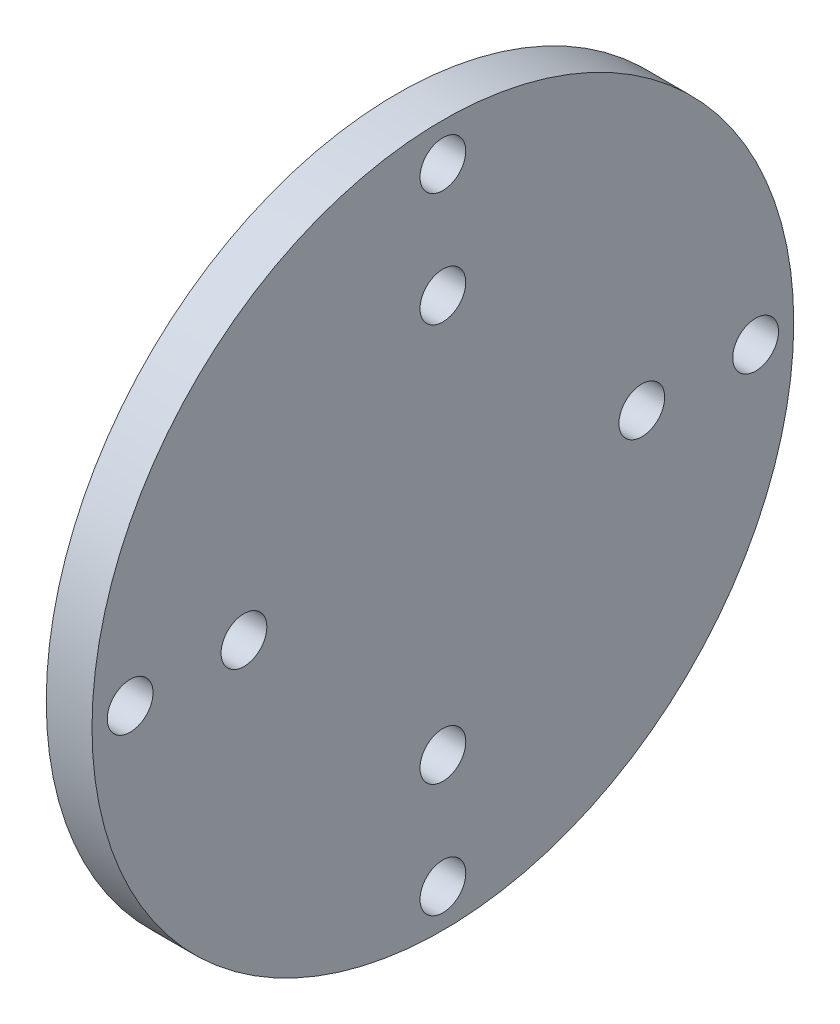
ISO-10303-21;
HEADER;
FILE_DESCRIPTION(('STEP AP214'),'2;1');
FILE_NAME('part.step','',(''),(''),'','','');
FILE_SCHEMA(('AUTOMOTIVE_DESIGN { 1 0 10303 214 1 1 1 1 }'));
ENDSEC;
DATA;
#1=APPLICATION_CONTEXT('core data for automotive mechanical design processes');
#2=APPLICATION_PROTOCOL_DEFINITION('international standard','automotive_design',2000,#1);
#3=PRODUCT_CONTEXT('',#1,'mechanical');
#4=PRODUCT('Part','Part','',(#3));
#5=PRODUCT_RELATED_PRODUCT_CATEGORY('part','',(#4));
#6=PRODUCT_DEFINITION_FORMATION('','',#4);
#7=PRODUCT_DEFINITION_CONTEXT('part definition',#1,'design');
#8=PRODUCT_DEFINITION('design','',#6,#7);
#9=PRODUCT_DEFINITION_SHAPE('','',#8);
#10=(LENGTH_UNIT() NAMED_UNIT(*) SI_UNIT(.MILLI.,.METRE.));
#11=(NAMED_UNIT(*) PLANE_ANGLE_UNIT() SI_UNIT($,.RADIAN.));
#12=(NAMED_UNIT(*) SI_UNIT($,.STERADIAN.) SOLID_ANGLE_UNIT());
#13=UNCERTAINTY_MEASURE_WITH_UNIT(LENGTH_MEASURE(1.E-05),#10,'distance_accuracy_value','');
#14=(GEOMETRIC_REPRESENTATION_CONTEXT(3) GLOBAL_UNCERTAINTY_ASSIGNED_CONTEXT((#13)) GLOBAL_UNIT_ASSIGNED_CONTEXT((#10,
#11,#12)) REPRESENTATION_CONTEXT('',''));
#15=CARTESIAN_POINT('',(0.,0.,0.));
#16=DIRECTION('',(0.,0.,1.));
#17=DIRECTION('',(1.,0.,0.));
#18=AXIS2_PLACEMENT_3D('',#15,#16,#17);
#19=CARTESIAN_POINT('',(3.,16.5,0.));
#20=DIRECTION('',(1.,0.,0.));
#21=DIRECTION('',(0.,0.,-1.));
#22=AXIS2_PLACEMENT_3D('',#19,#20,#21);
#23=PLANE('',#22);
#24=CARTESIAN_POINT('',(3.,16.4999999999998,-20.5));
#25=DIRECTION('',(1.,0.,0.));
#26=DIRECTION('',(0.,0.,-1.));
#27=AXIS2_PLACEMENT_3D('',#24,#25,#26);
#28=CIRCLE('',#27,1.5);
#29=CARTESIAN_POINT('',(3.,16.4999999999998,-22.));
#30=VERTEX_POINT('',#29);
#31=EDGE_CURVE('E96',#30,#30,#28,.T.);
#32=ORIENTED_EDGE('',*,*,#31,.F.);
#33=EDGE_LOOP('',(#32));
#34=FACE_BOUND('',#33,.T.);
#35=CARTESIAN_POINT('',(3.,37.,-1.41492685052928E-13));
#36=DIRECTION('',(1.,0.,0.));
#37=DIRECTION('',(0.,0.,-1.));
#38=AXIS2_PLACEMENT_3D('',#35,#36,#37);
#39=CIRCLE('',#38,1.5);
#40=CARTESIAN_POINT('',(3.,37.,-1.50000000000014));
#41=VERTEX_POINT('',#40);
#42=EDGE_CURVE('E80',#41,#41,#39,.T.);
#43=ORIENTED_EDGE('',*,*,#42,.F.);
#44=EDGE_LOOP('',(#43));
#45=FACE_BOUND('',#44,.T.);
#46=CARTESIAN_POINT('',(3.,16.5000000000001,20.5));
#47=DIRECTION('',(1.,0.,0.));
#48=DIRECTION('',(0.,0.,-1.));
#49=AXIS2_PLACEMENT_3D('',#46,#47,#48);
#50=CIRCLE('',#49,1.5);
#51=CARTESIAN_POINT('',(3.,16.5000000000001,19.));
#52=VERTEX_POINT('',#51);
#53=EDGE_CURVE('E64',#52,#52,#50,.T.);
#54=ORIENTED_EDGE('',*,*,#53,.F.);
#55=EDGE_LOOP('',(#54));
#56=FACE_BOUND('',#55,.T.);
#57=CARTESIAN_POINT('',(3.,-4.,0.));
#58=DIRECTION('',(1.,0.,0.));
#59=DIRECTION('',(0.,0.,-1.));
#60=AXIS2_PLACEMENT_3D('',#57,#58,#59);
#61=CIRCLE('',#60,1.5);
#62=CARTESIAN_POINT('',(3.,-4.,-1.5));
#63=VERTEX_POINT('',#62);
#64=EDGE_CURVE('E50',#63,#63,#61,.T.);
#65=ORIENTED_EDGE('',*,*,#64,.F.);
#66=EDGE_LOOP('',(#65));
#67=FACE_BOUND('',#66,.T.);
#68=CARTESIAN_POINT('',(3.,16.5,0.));
#69=DIRECTION('',(1.,0.,0.));
#70=DIRECTION('',(0.,0.,-1.));
#71=AXIS2_PLACEMENT_3D('',#68,#69,#70);
#72=CIRCLE('',#71,23.);
#73=CARTESIAN_POINT('',(3.,16.5,-23.));
#74=VERTEX_POINT('',#73);
#75=EDGE_CURVE('E10',#74,#74,#72,.T.);
#76=ORIENTED_EDGE('',*,*,#75,.T.);
#77=EDGE_LOOP('',(#76));
#78=FACE_BOUND('',#77,.T.);
#79=CARTESIAN_POINT('',(3.,3.46,0.));
#80=DIRECTION('',(1.,0.,0.));
#81=DIRECTION('',(0.,0.,-1.));
#82=AXIS2_PLACEMENT_3D('',#79,#80,#81);
#83=CIRCLE('',#82,1.5);
#84=CARTESIAN_POINT('',(3.,3.46,-1.49999999999997));
#85=VERTEX_POINT('',#84);
#86=EDGE_CURVE('E56',#85,#85,#83,.T.);
#87=ORIENTED_EDGE('',*,*,#86,.F.);
#88=EDGE_LOOP('',(#87));
#89=FACE_BOUND('',#88,.T.);
#90=CARTESIAN_POINT('',(3.,16.5000000000001,13.04));
#91=DIRECTION('',(1.,0.,0.));
#92=DIRECTION('',(0.,0.,-1.));
#93=AXIS2_PLACEMENT_3D('',#90,#91,#92);
#94=CIRCLE('',#93,1.5);
#95=CARTESIAN_POINT('',(3.,16.5000000000001,11.54));
#96=VERTEX_POINT('',#95);
#97=EDGE_CURVE('E72',#96,#96,#94,.T.);
#98=ORIENTED_EDGE('',*,*,#97,.F.);
#99=EDGE_LOOP('',(#98));
#100=FACE_BOUND('',#99,.T.);
#101=CARTESIAN_POINT('',(3.,29.54,-1.14989441009076E-13));
#102=DIRECTION('',(1.,0.,0.));
#103=DIRECTION('',(0.,0.,-1.));
#104=AXIS2_PLACEMENT_3D('',#101,#102,#103);
#105=CIRCLE('',#104,1.5);
#106=CARTESIAN_POINT('',(3.,29.54,-1.50000000000012));
#107=VERTEX_POINT('',#106);
#108=EDGE_CURVE('E88',#107,#107,#105,.T.);
#109=ORIENTED_EDGE('',*,*,#108,.F.);
#110=EDGE_LOOP('',(#109));
#111=FACE_BOUND('',#110,.T.);
#112=CARTESIAN_POINT('',(3.,16.4999999999998,-13.04));
#113=DIRECTION('',(1.,0.,0.));
#114=DIRECTION('',(0.,0.,-1.));
#115=AXIS2_PLACEMENT_3D('',#112,#113,#114);
#116=CIRCLE('',#115,1.5);
#117=CARTESIAN_POINT('',(3.,16.4999999999998,-14.54));
#118=VERTEX_POINT('',#117);
#119=EDGE_CURVE('E104',#118,#118,#116,.T.);
#120=ORIENTED_EDGE('',*,*,#119,.F.);
#121=EDGE_LOOP('',(#120));
#122=FACE_BOUND('',#121,.T.);
#123=ADVANCED_FACE('F37',(#34,#45,#56,#67,#78,#89,#100,#111,#122),#23,.T.);
#124=CARTESIAN_POINT('',(0.,16.5,0.));
#125=DIRECTION('',(1.,0.,0.));
#126=DIRECTION('',(0.,0.,-1.));
#127=AXIS2_PLACEMENT_3D('',#124,#125,#126);
#128=PLANE('',#127);
#129=CARTESIAN_POINT('',(0.,16.5,0.));
#130=DIRECTION('',(1.,0.,0.));
#131=DIRECTION('',(0.,0.,-1.));
#132=AXIS2_PLACEMENT_3D('',#129,#130,#131);
#133=CIRCLE('',#132,23.);
#134=CARTESIAN_POINT('',(0.,16.5,-23.));
#135=VERTEX_POINT('',#134);
#136=EDGE_CURVE('E41',#135,#135,#133,.T.);
#137=ORIENTED_EDGE('',*,*,#136,.F.);
#138=EDGE_LOOP('',(#137));
#139=FACE_BOUND('',#138,.T.);
#140=CARTESIAN_POINT('',(0.,-4.,0.));
#141=DIRECTION('',(1.,0.,0.));
#142=DIRECTION('',(0.,0.,-1.));
#143=AXIS2_PLACEMENT_3D('',#140,#141,#142);
#144=CIRCLE('',#143,1.5);
#145=CARTESIAN_POINT('',(0.,-4.,-1.5));
#146=VERTEX_POINT('',#145);
#147=EDGE_CURVE('E52',#146,#146,#144,.T.);
#148=ORIENTED_EDGE('',*,*,#147,.T.);
#149=EDGE_LOOP('',(#148));
#150=FACE_BOUND('',#149,.T.);
#151=CARTESIAN_POINT('',(0.,3.46,0.));
#152=DIRECTION('',(1.,0.,0.));
#153=DIRECTION('',(0.,0.,-1.));
#154=AXIS2_PLACEMENT_3D('',#151,#152,#153);
#155=CIRCLE('',#154,1.5);
#156=CARTESIAN_POINT('',(0.,3.46,-1.49999999999997));
#157=VERTEX_POINT('',#156);
#158=EDGE_CURVE('E60',#157,#157,#155,.T.);
#159=ORIENTED_EDGE('',*,*,#158,.T.);
#160=EDGE_LOOP('',(#159));
#161=FACE_BOUND('',#160,.T.);
#162=CARTESIAN_POINT('',(0.,16.5000000000001,20.5));
#163=DIRECTION('',(1.,0.,0.));
#164=DIRECTION('',(0.,0.,-1.));
#165=AXIS2_PLACEMENT_3D('',#162,#163,#164);
#166=CIRCLE('',#165,1.5);
#167=CARTESIAN_POINT('',(0.,16.5000000000001,19.));
#168=VERTEX_POINT('',#167);
#169=EDGE_CURVE('E68',#168,#168,#166,.T.);
#170=ORIENTED_EDGE('',*,*,#169,.T.);
#171=EDGE_LOOP('',(#170));
#172=FACE_BOUND('',#171,.T.);
#173=CARTESIAN_POINT('',(0.,16.5000000000001,13.04));
#174=DIRECTION('',(1.,0.,0.));
#175=DIRECTION('',(0.,0.,-1.));
#176=AXIS2_PLACEMENT_3D('',#173,#174,#175);
#177=CIRCLE('',#176,1.5);
#178=CARTESIAN_POINT('',(0.,16.5000000000001,11.54));
#179=VERTEX_POINT('',#178);
#180=EDGE_CURVE('E76',#179,#179,#177,.T.);
#181=ORIENTED_EDGE('',*,*,#180,.T.);
#182=EDGE_LOOP('',(#181));
#183=FACE_BOUND('',#182,.T.);
#184=CARTESIAN_POINT('',(0.,37.,-1.41492685052928E-13));
#185=DIRECTION('',(1.,0.,0.));
#186=DIRECTION('',(0.,0.,-1.));
#187=AXIS2_PLACEMENT_3D('',#184,#185,#186);
#188=CIRCLE('',#187,1.5);
#189=CARTESIAN_POINT('',(0.,37.,-1.50000000000014));
#190=VERTEX_POINT('',#189);
#191=EDGE_CURVE('E84',#190,#190,#188,.T.);
#192=ORIENTED_EDGE('',*,*,#191,.T.);
#193=EDGE_LOOP('',(#192));
#194=FACE_BOUND('',#193,.T.);
#195=CARTESIAN_POINT('',(0.,29.54,-1.14989441009076E-13));
#196=DIRECTION('',(1.,0.,0.));
#197=DIRECTION('',(0.,0.,-1.));
#198=AXIS2_PLACEMENT_3D('',#195,#196,#197);
#199=CIRCLE('',#198,1.5);
#200=CARTESIAN_POINT('',(0.,29.54,-1.50000000000012));
#201=VERTEX_POINT('',#200);
#202=EDGE_CURVE('E92',#201,#201,#199,.T.);
#203=ORIENTED_EDGE('',*,*,#202,.T.);
#204=EDGE_LOOP('',(#203));
#205=FACE_BOUND('',#204,.T.);
#206=CARTESIAN_POINT('',(0.,16.4999999999998,-20.5));
#207=DIRECTION('',(1.,0.,0.));
#208=DIRECTION('',(0.,0.,-1.));
#209=AXIS2_PLACEMENT_3D('',#206,#207,#208);
#210=CIRCLE('',#209,1.5);
#211=CARTESIAN_POINT('',(0.,16.4999999999998,-22.));
#212=VERTEX_POINT('',#211);
#213=EDGE_CURVE('E100',#212,#212,#210,.T.);
#214=ORIENTED_EDGE('',*,*,#213,.T.);
#215=EDGE_LOOP('',(#214));
#216=FACE_BOUND('',#215,.T.);
#217=CARTESIAN_POINT('',(0.,16.4999999999998,-13.04));
#218=DIRECTION('',(1.,0.,0.));
#219=DIRECTION('',(0.,0.,-1.));
#220=AXIS2_PLACEMENT_3D('',#217,#218,#219);
#221=CIRCLE('',#220,1.5);
#222=CARTESIAN_POINT('',(0.,16.4999999999998,-14.54));
#223=VERTEX_POINT('',#222);
#224=EDGE_CURVE('E108',#223,#223,#221,.T.);
#225=ORIENTED_EDGE('',*,*,#224,.T.);
#226=EDGE_LOOP('',(#225));
#227=FACE_BOUND('',#226,.T.);
#228=ADVANCED_FACE('F120',(#139,#150,#161,#172,#183,#194,#205,#216,#227),#128,.F.);
#229=CARTESIAN_POINT('',(3.,16.5,0.));
#230=DIRECTION('',(-1.,0.,0.));
#231=DIRECTION('',(0.,0.,1.));
#232=AXIS2_PLACEMENT_3D('',#229,#230,#231);
#233=CYLINDRICAL_SURFACE('',#232,23.);
#234=ORIENTED_EDGE('',*,*,#75,.F.);
#235=EDGE_LOOP('',(#234));
#236=FACE_BOUND('',#235,.T.);
#237=ORIENTED_EDGE('',*,*,#136,.T.);
#238=EDGE_LOOP('',(#237));
#239=FACE_BOUND('',#238,.T.);
#240=ADVANCED_FACE('F39',(#236,#239),#233,.T.);
#241=CARTESIAN_POINT('',(3.,-4.,0.));
#242=DIRECTION('',(-1.,0.,0.));
#243=DIRECTION('',(0.,0.,1.));
#244=AXIS2_PLACEMENT_3D('',#241,#242,#243);
#245=CYLINDRICAL_SURFACE('',#244,1.5);
#246=ORIENTED_EDGE('',*,*,#64,.T.);
#247=EDGE_LOOP('',(#246));
#248=FACE_BOUND('',#247,.T.);
#249=ORIENTED_EDGE('',*,*,#147,.F.);
#250=EDGE_LOOP('',(#249));
#251=FACE_BOUND('',#250,.T.);
#252=ADVANCED_FACE('F130',(#248,#251),#245,.F.);
#253=CARTESIAN_POINT('',(3.,3.46,0.));
#254=DIRECTION('',(-1.,0.,0.));
#255=DIRECTION('',(0.,0.,1.));
#256=AXIS2_PLACEMENT_3D('',#253,#254,#255);
#257=CYLINDRICAL_SURFACE('',#256,1.5);
#258=ORIENTED_EDGE('',*,*,#86,.T.);
#259=EDGE_LOOP('',(#258));
#260=FACE_BOUND('',#259,.T.);
#261=ORIENTED_EDGE('',*,*,#158,.F.);
#262=EDGE_LOOP('',(#261));
#263=FACE_BOUND('',#262,.T.);
#264=ADVANCED_FACE('F133',(#260,#263),#257,.F.);
#265=CARTESIAN_POINT('',(3.,16.5000000000001,20.5));
#266=DIRECTION('',(-1.,0.,0.));
#267=DIRECTION('',(0.,0.,1.));
#268=AXIS2_PLACEMENT_3D('',#265,#266,#267);
#269=CYLINDRICAL_SURFACE('',#268,1.5);
#270=ORIENTED_EDGE('',*,*,#53,.T.);
#271=EDGE_LOOP('',(#270));
#272=FACE_BOUND('',#271,.T.);
#273=ORIENTED_EDGE('',*,*,#169,.F.);
#274=EDGE_LOOP('',(#273));
#275=FACE_BOUND('',#274,.T.);
#276=ADVANCED_FACE('F137',(#272,#275),#269,.F.);
#277=CARTESIAN_POINT('',(3.,16.5000000000001,13.04));
#278=DIRECTION('',(-1.,0.,0.));
#279=DIRECTION('',(0.,0.,1.));
#280=AXIS2_PLACEMENT_3D('',#277,#278,#279);
#281=CYLINDRICAL_SURFACE('',#280,1.5);
#282=ORIENTED_EDGE('',*,*,#97,.T.);
#283=EDGE_LOOP('',(#282));
#284=FACE_BOUND('',#283,.T.);
#285=ORIENTED_EDGE('',*,*,#180,.F.);
#286=EDGE_LOOP('',(#285));
#287=FACE_BOUND('',#286,.T.);
#288=ADVANCED_FACE('F141',(#284,#287),#281,.F.);
#289=CARTESIAN_POINT('',(3.,37.,-1.41492685052928E-13));
#290=DIRECTION('',(-1.,0.,0.));
#291=DIRECTION('',(0.,0.,1.));
#292=AXIS2_PLACEMENT_3D('',#289,#290,#291);
#293=CYLINDRICAL_SURFACE('',#292,1.5);
#294=ORIENTED_EDGE('',*,*,#42,.T.);
#295=EDGE_LOOP('',(#294));
#296=FACE_BOUND('',#295,.T.);
#297=ORIENTED_EDGE('',*,*,#191,.F.);
#298=EDGE_LOOP('',(#297));
#299=FACE_BOUND('',#298,.T.);
#300=ADVANCED_FACE('F145',(#296,#299),#293,.F.);
#301=CARTESIAN_POINT('',(3.,29.54,-1.14989441009076E-13));
#302=DIRECTION('',(-1.,0.,0.));
#303=DIRECTION('',(0.,0.,1.));
#304=AXIS2_PLACEMENT_3D('',#301,#302,#303);
#305=CYLINDRICAL_SURFACE('',#304,1.5);
#306=ORIENTED_EDGE('',*,*,#108,.T.);
#307=EDGE_LOOP('',(#306));
#308=FACE_BOUND('',#307,.T.);
#309=ORIENTED_EDGE('',*,*,#202,.F.);
#310=EDGE_LOOP('',(#309));
#311=FACE_BOUND('',#310,.T.);
#312=ADVANCED_FACE('F149',(#308,#311),#305,.F.);
#313=CARTESIAN_POINT('',(3.,16.4999999999998,-20.5));
#314=DIRECTION('',(-1.,0.,0.));
#315=DIRECTION('',(0.,0.,1.));
#316=AXIS2_PLACEMENT_3D('',#313,#314,#315);
#317=CYLINDRICAL_SURFACE('',#316,1.5);
#318=ORIENTED_EDGE('',*,*,#31,.T.);
#319=EDGE_LOOP('',(#318));
#320=FACE_BOUND('',#319,.T.);
#321=ORIENTED_EDGE('',*,*,#213,.F.);
#322=EDGE_LOOP('',(#321));
#323=FACE_BOUND('',#322,.T.);
#324=ADVANCED_FACE('F153',(#320,#323),#317,.F.);
#325=CARTESIAN_POINT('',(3.,16.4999999999998,-13.04));
#326=DIRECTION('',(-1.,0.,0.));
#327=DIRECTION('',(0.,0.,1.));
#328=AXIS2_PLACEMENT_3D('',#325,#326,#327);
#329=CYLINDRICAL_SURFACE('',#328,1.5);
#330=ORIENTED_EDGE('',*,*,#119,.T.);
#331=EDGE_LOOP('',(#330));
#332=FACE_BOUND('',#331,.T.);
#333=ORIENTED_EDGE('',*,*,#224,.F.);
#334=EDGE_LOOP('',(#333));
#335=FACE_BOUND('',#334,.T.);
#336=ADVANCED_FACE('F116',(#332,#335),#329,.F.);
#337=CLOSED_SHELL('',(#123,#228,#240,#252,#264,#276,#288,#300,#312,#324,#336));
#338=MANIFOLD_SOLID_BREP('B2',#337);
#339=ADVANCED_BREP_SHAPE_REPRESENTATION('',(#18,#338),#14);
#340=SHAPE_DEFINITION_REPRESENTATION(#9,#339);
ENDSEC;
END-ISO-10303-21;
